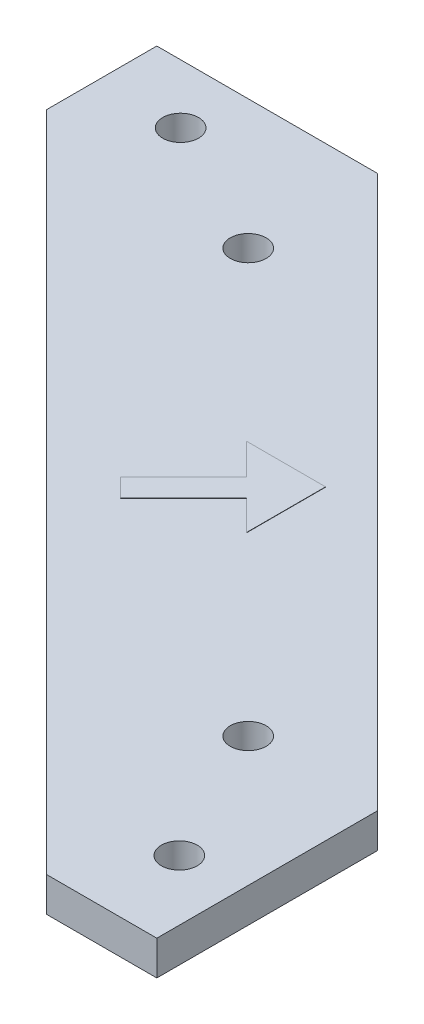
ISO-10303-21;
HEADER;
FILE_DESCRIPTION(('STEP AP214'),'2;1');
FILE_NAME('part.step','',(''),(''),'','','');
FILE_SCHEMA(('AUTOMOTIVE_DESIGN { 1 0 10303 214 1 1 1 1 }'));
ENDSEC;
DATA;
#1=APPLICATION_CONTEXT('core data for automotive mechanical design processes');
#2=APPLICATION_PROTOCOL_DEFINITION('international standard','automotive_design',2000,#1);
#3=PRODUCT_CONTEXT('',#1,'mechanical');
#4=PRODUCT('Part','Part','',(#3));
#5=PRODUCT_RELATED_PRODUCT_CATEGORY('part','',(#4));
#6=PRODUCT_DEFINITION_FORMATION('','',#4);
#7=PRODUCT_DEFINITION_CONTEXT('part definition',#1,'design');
#8=PRODUCT_DEFINITION('design','',#6,#7);
#9=PRODUCT_DEFINITION_SHAPE('','',#8);
#10=(LENGTH_UNIT() NAMED_UNIT(*) SI_UNIT(.MILLI.,.METRE.));
#11=(NAMED_UNIT(*) PLANE_ANGLE_UNIT() SI_UNIT($,.RADIAN.));
#12=(NAMED_UNIT(*) SI_UNIT($,.STERADIAN.) SOLID_ANGLE_UNIT());
#13=UNCERTAINTY_MEASURE_WITH_UNIT(LENGTH_MEASURE(1.E-05),#10,'distance_accuracy_value','');
#14=(GEOMETRIC_REPRESENTATION_CONTEXT(3) GLOBAL_UNCERTAINTY_ASSIGNED_CONTEXT((#13)) GLOBAL_UNIT_ASSIGNED_CONTEXT((#10,
#11,#12)) REPRESENTATION_CONTEXT('',''));
#15=CARTESIAN_POINT('',(0.,0.,0.));
#16=DIRECTION('',(0.,0.,1.));
#17=DIRECTION('',(1.,0.,0.));
#18=AXIS2_PLACEMENT_3D('',#15,#16,#17);
#19=CARTESIAN_POINT('',(0.,3.175,0.));
#20=DIRECTION('',(0.,1.,0.));
#21=DIRECTION('',(0.,0.,1.));
#22=AXIS2_PLACEMENT_3D('',#19,#20,#21);
#23=PLANE('',#22);
#24=CARTESIAN_POINT('',(-63.5,3.175,5.42925000000001));
#25=DIRECTION('',(0.,1.,0.));
#26=DIRECTION('',(0.,0.,1.));
#27=AXIS2_PLACEMENT_3D('',#24,#25,#26);
#28=CIRCLE('',#27,1.65099999999998);
#29=CARTESIAN_POINT('',(-63.5,3.175,7.08024999999999));
#30=VERTEX_POINT('',#29);
#31=EDGE_CURVE('E170',#30,#30,#28,.T.);
#32=ORIENTED_EDGE('',*,*,#31,.F.);
#33=EDGE_LOOP('',(#32));
#34=FACE_BOUND('',#33,.T.);
#35=CARTESIAN_POINT('',(-50.8,3.175,11.90625));
#36=DIRECTION('',(0.,1.,0.));
#37=DIRECTION('',(0.,0.,1.));
#38=AXIS2_PLACEMENT_3D('',#35,#36,#37);
#39=CIRCLE('',#38,1.65099999999999);
#40=CARTESIAN_POINT('',(-50.8,3.175,13.55725));
#41=VERTEX_POINT('',#40);
#42=EDGE_CURVE('E222',#41,#41,#39,.T.);
#43=ORIENTED_EDGE('',*,*,#42,.F.);
#44=EDGE_LOOP('',(#43));
#45=FACE_BOUND('',#44,.T.);
#46=CARTESIAN_POINT('',(-5.55624999999999,3.175,63.4921081380802));
#47=DIRECTION('',(0.,1.,0.));
#48=DIRECTION('',(0.,0.,1.));
#49=AXIS2_PLACEMENT_3D('',#46,#47,#48);
#50=CIRCLE('',#49,1.65099999999999);
#51=CARTESIAN_POINT('',(-5.55624999999999,3.175,65.1431081380802));
#52=VERTEX_POINT('',#51);
#53=EDGE_CURVE('E414',#52,#52,#50,.T.);
#54=ORIENTED_EDGE('',*,*,#53,.F.);
#55=EDGE_LOOP('',(#54));
#56=FACE_BOUND('',#55,.T.);
#57=CARTESIAN_POINT('',(-11.90625,3.175,50.8));
#58=DIRECTION('',(0.,1.,0.));
#59=DIRECTION('',(0.,0.,1.));
#60=AXIS2_PLACEMENT_3D('',#57,#58,#59);
#61=CIRCLE('',#60,1.651);
#62=CARTESIAN_POINT('',(-11.90625,3.175,52.451));
#63=VERTEX_POINT('',#62);
#64=EDGE_CURVE('E418',#63,#63,#61,.T.);
#65=ORIENTED_EDGE('',*,*,#64,.F.);
#66=EDGE_LOOP('',(#65));
#67=FACE_BOUND('',#66,.T.);
#68=DIRECTION('',(-1.,0.,0.));
#69=VECTOR('',#68,1.);
#70=CARTESIAN_POINT('',(0.,3.175,71.12));
#71=LINE('',#70,#69);
#72=CARTESIAN_POINT('',(0.,3.175,71.12));
#73=VERTEX_POINT('',#72);
#74=CARTESIAN_POINT('',(-10.16,3.175,71.12));
#75=VERTEX_POINT('',#74);
#76=EDGE_CURVE('E422',#73,#75,#71,.T.);
#77=ORIENTED_EDGE('',*,*,#76,.F.);
#78=DIRECTION('',(0.,0.,1.));
#79=VECTOR('',#78,1.);
#80=CARTESIAN_POINT('',(0.,3.175,0.));
#81=LINE('',#80,#79);
#82=CARTESIAN_POINT('',(0.,3.175,50.8));
#83=VERTEX_POINT('',#82);
#84=EDGE_CURVE('E425',#83,#73,#81,.T.);
#85=ORIENTED_EDGE('',*,*,#84,.F.);
#86=DIRECTION('',(0.707106781186548,0.,0.707106781186548));
#87=VECTOR('',#86,1.);
#88=CARTESIAN_POINT('',(-25.4,3.175,25.4));
#89=LINE('',#88,#87);
#90=CARTESIAN_POINT('',(-50.8,3.175,0.));
#91=VERTEX_POINT('',#90);
#92=EDGE_CURVE('E126',#91,#83,#89,.T.);
#93=ORIENTED_EDGE('',*,*,#92,.F.);
#94=DIRECTION('',(-1.,0.,0.));
#95=VECTOR('',#94,1.);
#96=CARTESIAN_POINT('',(0.,3.175,0.));
#97=LINE('',#96,#95);
#98=CARTESIAN_POINT('',(-71.12,3.175,0.));
#99=VERTEX_POINT('',#98);
#100=EDGE_CURVE('E119',#91,#99,#97,.T.);
#101=ORIENTED_EDGE('',*,*,#100,.T.);
#102=DIRECTION('',(0.,0.,1.));
#103=VECTOR('',#102,1.);
#104=CARTESIAN_POINT('',(-71.12,3.175,0.));
#105=LINE('',#104,#103);
#106=CARTESIAN_POINT('',(-71.12,3.175,10.16));
#107=VERTEX_POINT('',#106);
#108=EDGE_CURVE('E109',#99,#107,#105,.T.);
#109=ORIENTED_EDGE('',*,*,#108,.T.);
#110=DIRECTION('',(0.707106781186548,0.,0.707106781186547));
#111=VECTOR('',#110,1.);
#112=CARTESIAN_POINT('',(-40.64,3.175,40.64));
#113=LINE('',#112,#111);
#114=EDGE_CURVE('E66',#107,#75,#113,.T.);
#115=ORIENTED_EDGE('',*,*,#114,.T.);
#116=EDGE_LOOP('',(#77,#85,#93,#101,#109,#115));
#117=FACE_BOUND('',#116,.T.);
#118=DIRECTION('',(-1.,0.,0.));
#119=VECTOR('',#118,1.);
#120=CARTESIAN_POINT('',(-28.1859829338365,3.175,27.4008880328545));
#121=LINE('',#120,#119);
#122=CARTESIAN_POINT('',(-28.1859829338365,3.175,27.4008880328545));
#123=VERTEX_POINT('',#122);
#124=CARTESIAN_POINT('',(-35.4748823051124,3.175,27.4008880328545));
#125=VERTEX_POINT('',#124);
#126=EDGE_CURVE('E470',#123,#125,#121,.T.);
#127=ORIENTED_EDGE('',*,*,#126,.F.);
#128=DIRECTION('',(0.,0.,-1.));
#129=VECTOR('',#128,1.);
#130=CARTESIAN_POINT('',(-28.1859829338365,3.175,27.4008880328545));
#131=LINE('',#130,#129);
#132=CARTESIAN_POINT('',(-28.1859829338365,3.175,34.6897874041304));
#133=VERTEX_POINT('',#132);
#134=EDGE_CURVE('E397',#133,#123,#131,.T.);
#135=ORIENTED_EDGE('',*,*,#134,.F.);
#136=DIRECTION('',(0.707106781186548,0.,0.707106781186548));
#137=VECTOR('',#136,1.);
#138=CARTESIAN_POINT('',(-28.1859829338365,3.175,34.6897874041304));
#139=LINE('',#138,#137);
#140=CARTESIAN_POINT('',(-30.9407107968624,3.175,31.9350595411045));
#141=VERTEX_POINT('',#140);
#142=EDGE_CURVE('E391',#141,#133,#139,.T.);
#143=ORIENTED_EDGE('',*,*,#142,.F.);
#144=DIRECTION('',(0.707106781186548,0.,-0.707106781186548));
#145=VECTOR('',#144,1.);
#146=CARTESIAN_POINT('',(-30.9407107968624,3.175,31.9350595411045));
#147=LINE('',#146,#145);
#148=CARTESIAN_POINT('',(-36.7299801539523,3.175,37.7243288981944));
#149=VERTEX_POINT('',#148);
#150=EDGE_CURVE('E455',#149,#141,#147,.T.);
#151=ORIENTED_EDGE('',*,*,#150,.F.);
#152=DIRECTION('',(0.707106781186546,0.,0.707106781186549));
#153=VECTOR('',#152,1.);
#154=CARTESIAN_POINT('',(-38.3847186848957,3.175,36.069590367251));
#155=LINE('',#154,#153);
#156=CARTESIAN_POINT('',(-38.3847186848957,3.175,36.069590367251));
#157=VERTEX_POINT('',#156);
#158=EDGE_CURVE('E458',#157,#149,#155,.T.);
#159=ORIENTED_EDGE('',*,*,#158,.F.);
#160=DIRECTION('',(-0.707106781186548,0.,0.707106781186548));
#161=VECTOR('',#160,1.);
#162=CARTESIAN_POINT('',(-32.5954493278058,3.175,30.2803210101611));
#163=LINE('',#162,#161);
#164=CARTESIAN_POINT('',(-32.5954493278058,3.175,30.2803210101611));
#165=VERTEX_POINT('',#164);
#166=EDGE_CURVE('E462',#165,#157,#163,.T.);
#167=ORIENTED_EDGE('',*,*,#166,.F.);
#168=DIRECTION('',(0.707106781186547,0.,0.707106781186548));
#169=VECTOR('',#168,1.);
#170=CARTESIAN_POINT('',(-35.4748823051124,3.175,27.4008880328545));
#171=LINE('',#170,#169);
#172=EDGE_CURVE('E466',#125,#165,#171,.T.);
#173=ORIENTED_EDGE('',*,*,#172,.F.);
#174=EDGE_LOOP('',(#127,#135,#143,#151,#159,#167,#173));
#175=FACE_BOUND('',#174,.T.);
#176=ADVANCED_FACE('F41',(#34,#45,#56,#67,#117,#175),#23,.T.);
#177=CARTESIAN_POINT('',(0.,3.175,71.12));
#178=DIRECTION('',(0.,0.,1.));
#179=DIRECTION('',(1.,0.,0.));
#180=AXIS2_PLACEMENT_3D('',#177,#178,#179);
#181=PLANE('',#180);
#182=DIRECTION('',(-1.,0.,0.));
#183=VECTOR('',#182,1.);
#184=CARTESIAN_POINT('',(0.,0.,71.12));
#185=LINE('',#184,#183);
#186=CARTESIAN_POINT('',(0.,0.,71.12));
#187=VERTEX_POINT('',#186);
#188=CARTESIAN_POINT('',(-10.16,0.,71.12));
#189=VERTEX_POINT('',#188);
#190=EDGE_CURVE('E156',#187,#189,#185,.T.);
#191=ORIENTED_EDGE('',*,*,#190,.F.);
#192=DIRECTION('',(0.,-1.,0.));
#193=VECTOR('',#192,1.);
#194=CARTESIAN_POINT('',(0.,3.175,71.12));
#195=LINE('',#194,#193);
#196=EDGE_CURVE('E11',#73,#187,#195,.T.);
#197=ORIENTED_EDGE('',*,*,#196,.F.);
#198=ORIENTED_EDGE('',*,*,#76,.T.);
#199=DIRECTION('',(0.,-1.,0.));
#200=VECTOR('',#199,1.);
#201=CARTESIAN_POINT('',(-10.16,3.175,71.12));
#202=LINE('',#201,#200);
#203=EDGE_CURVE('E92',#75,#189,#202,.T.);
#204=ORIENTED_EDGE('',*,*,#203,.T.);
#205=EDGE_LOOP('',(#191,#197,#198,#204));
#206=FACE_BOUND('',#205,.T.);
#207=ADVANCED_FACE('F192',(#206),#181,.T.);
#208=CARTESIAN_POINT('',(0.,3.175,0.));
#209=DIRECTION('',(1.,0.,0.));
#210=DIRECTION('',(0.,0.,-1.));
#211=AXIS2_PLACEMENT_3D('',#208,#209,#210);
#212=PLANE('',#211);
#213=DIRECTION('',(0.,0.,1.));
#214=VECTOR('',#213,1.);
#215=CARTESIAN_POINT('',(0.,0.,0.));
#216=LINE('',#215,#214);
#217=CARTESIAN_POINT('',(0.,0.,50.8));
#218=VERTEX_POINT('',#217);
#219=EDGE_CURVE('E151',#218,#187,#216,.T.);
#220=ORIENTED_EDGE('',*,*,#219,.F.);
#221=DIRECTION('',(0.,-1.,0.));
#222=VECTOR('',#221,1.);
#223=CARTESIAN_POINT('',(0.,3.175,50.8));
#224=LINE('',#223,#222);
#225=EDGE_CURVE('E50',#83,#218,#224,.T.);
#226=ORIENTED_EDGE('',*,*,#225,.F.);
#227=ORIENTED_EDGE('',*,*,#84,.T.);
#228=ORIENTED_EDGE('',*,*,#196,.T.);
#229=EDGE_LOOP('',(#220,#226,#227,#228));
#230=FACE_BOUND('',#229,.T.);
#231=ADVANCED_FACE('F152',(#230),#212,.T.);
#232=CARTESIAN_POINT('',(-25.4,3.175,25.4));
#233=DIRECTION('',(0.707106781186548,0.,-0.707106781186548));
#234=DIRECTION('',(-0.707106781186548,0.,-0.707106781186548));
#235=AXIS2_PLACEMENT_3D('',#232,#233,#234);
#236=PLANE('',#235);
#237=DIRECTION('',(0.707106781186548,0.,0.707106781186548));
#238=VECTOR('',#237,1.);
#239=CARTESIAN_POINT('',(-25.4,0.,25.4));
#240=LINE('',#239,#238);
#241=CARTESIAN_POINT('',(-50.8,0.,0.));
#242=VERTEX_POINT('',#241);
#243=EDGE_CURVE('E147',#242,#218,#240,.T.);
#244=ORIENTED_EDGE('',*,*,#243,.F.);
#245=DIRECTION('',(0.,-1.,0.));
#246=VECTOR('',#245,1.);
#247=CARTESIAN_POINT('',(-50.8,3.175,0.));
#248=LINE('',#247,#246);
#249=EDGE_CURVE('E134',#91,#242,#248,.T.);
#250=ORIENTED_EDGE('',*,*,#249,.F.);
#251=ORIENTED_EDGE('',*,*,#92,.T.);
#252=ORIENTED_EDGE('',*,*,#225,.T.);
#253=EDGE_LOOP('',(#244,#250,#251,#252));
#254=FACE_BOUND('',#253,.T.);
#255=ADVANCED_FACE('F145',(#254),#236,.T.);
#256=CARTESIAN_POINT('',(0.,3.175,0.));
#257=DIRECTION('',(0.,0.,1.));
#258=DIRECTION('',(1.,0.,0.));
#259=AXIS2_PLACEMENT_3D('',#256,#257,#258);
#260=PLANE('',#259);
#261=DIRECTION('',(-1.,0.,0.));
#262=VECTOR('',#261,1.);
#263=CARTESIAN_POINT('',(0.,0.,0.));
#264=LINE('',#263,#262);
#265=CARTESIAN_POINT('',(-71.12,0.,0.));
#266=VERTEX_POINT('',#265);
#267=EDGE_CURVE('E132',#242,#266,#264,.T.);
#268=ORIENTED_EDGE('',*,*,#267,.T.);
#269=DIRECTION('',(0.,-1.,0.));
#270=VECTOR('',#269,1.);
#271=CARTESIAN_POINT('',(-71.12,3.175,0.));
#272=LINE('',#271,#270);
#273=EDGE_CURVE('E114',#99,#266,#272,.T.);
#274=ORIENTED_EDGE('',*,*,#273,.F.);
#275=ORIENTED_EDGE('',*,*,#100,.F.);
#276=ORIENTED_EDGE('',*,*,#249,.T.);
#277=EDGE_LOOP('',(#268,#274,#275,#276));
#278=FACE_BOUND('',#277,.T.);
#279=ADVANCED_FACE('F130',(#278),#260,.F.);
#280=CARTESIAN_POINT('',(-71.12,3.175,0.));
#281=DIRECTION('',(1.,0.,0.));
#282=DIRECTION('',(0.,0.,-1.));
#283=AXIS2_PLACEMENT_3D('',#280,#281,#282);
#284=PLANE('',#283);
#285=DIRECTION('',(0.,0.,1.));
#286=VECTOR('',#285,1.);
#287=CARTESIAN_POINT('',(-71.12,0.,0.));
#288=LINE('',#287,#286);
#289=CARTESIAN_POINT('',(-71.12,0.,10.16));
#290=VERTEX_POINT('',#289);
#291=EDGE_CURVE('E162',#266,#290,#288,.T.);
#292=ORIENTED_EDGE('',*,*,#291,.T.);
#293=DIRECTION('',(0.,-1.,0.));
#294=VECTOR('',#293,1.);
#295=CARTESIAN_POINT('',(-71.12,3.175,10.16));
#296=LINE('',#295,#294);
#297=EDGE_CURVE('E117',#107,#290,#296,.T.);
#298=ORIENTED_EDGE('',*,*,#297,.F.);
#299=ORIENTED_EDGE('',*,*,#108,.F.);
#300=ORIENTED_EDGE('',*,*,#273,.T.);
#301=EDGE_LOOP('',(#292,#298,#299,#300));
#302=FACE_BOUND('',#301,.T.);
#303=ADVANCED_FACE('F112',(#302),#284,.F.);
#304=CARTESIAN_POINT('',(-11.90625,3.175,50.8));
#305=DIRECTION('',(0.,-1.,0.));
#306=DIRECTION('',(0.,0.,-1.));
#307=AXIS2_PLACEMENT_3D('',#304,#305,#306);
#308=CYLINDRICAL_SURFACE('',#307,1.651);
#309=ORIENTED_EDGE('',*,*,#64,.T.);
#310=EDGE_LOOP('',(#309));
#311=FACE_BOUND('',#310,.T.);
#312=CARTESIAN_POINT('',(-11.90625,0.,50.8));
#313=DIRECTION('',(0.,1.,0.));
#314=DIRECTION('',(0.,0.,1.));
#315=AXIS2_PLACEMENT_3D('',#312,#313,#314);
#316=CIRCLE('',#315,1.651);
#317=CARTESIAN_POINT('',(-11.90625,0.,52.451));
#318=VERTEX_POINT('',#317);
#319=EDGE_CURVE('E188',#318,#318,#316,.T.);
#320=ORIENTED_EDGE('',*,*,#319,.F.);
#321=EDGE_LOOP('',(#320));
#322=FACE_BOUND('',#321,.T.);
#323=ADVANCED_FACE('F204',(#311,#322),#308,.F.);
#324=CARTESIAN_POINT('',(-5.55624999999999,3.175,63.4921081380802));
#325=DIRECTION('',(0.,-1.,0.));
#326=DIRECTION('',(0.,0.,-1.));
#327=AXIS2_PLACEMENT_3D('',#324,#325,#326);
#328=CYLINDRICAL_SURFACE('',#327,1.65099999999999);
#329=ORIENTED_EDGE('',*,*,#53,.T.);
#330=EDGE_LOOP('',(#329));
#331=FACE_BOUND('',#330,.T.);
#332=CARTESIAN_POINT('',(-5.55624999999999,0.,63.4921081380802));
#333=DIRECTION('',(0.,1.,0.));
#334=DIRECTION('',(0.,0.,1.));
#335=AXIS2_PLACEMENT_3D('',#332,#333,#334);
#336=CIRCLE('',#335,1.65099999999999);
#337=CARTESIAN_POINT('',(-5.55624999999999,0.,65.1431081380802));
#338=VERTEX_POINT('',#337);
#339=EDGE_CURVE('E184',#338,#338,#336,.T.);
#340=ORIENTED_EDGE('',*,*,#339,.F.);
#341=EDGE_LOOP('',(#340));
#342=FACE_BOUND('',#341,.T.);
#343=ADVANCED_FACE('F207',(#331,#342),#328,.F.);
#344=CARTESIAN_POINT('',(-50.8,3.175,11.90625));
#345=DIRECTION('',(0.,-1.,0.));
#346=DIRECTION('',(0.,0.,-1.));
#347=AXIS2_PLACEMENT_3D('',#344,#345,#346);
#348=CYLINDRICAL_SURFACE('',#347,1.65099999999999);
#349=ORIENTED_EDGE('',*,*,#42,.T.);
#350=EDGE_LOOP('',(#349));
#351=FACE_BOUND('',#350,.T.);
#352=CARTESIAN_POINT('',(-50.8,0.,11.90625));
#353=DIRECTION('',(0.,1.,0.));
#354=DIRECTION('',(0.,0.,1.));
#355=AXIS2_PLACEMENT_3D('',#352,#353,#354);
#356=CIRCLE('',#355,1.65099999999999);
#357=CARTESIAN_POINT('',(-50.8,0.,13.55725));
#358=VERTEX_POINT('',#357);
#359=EDGE_CURVE('E179',#358,#358,#356,.T.);
#360=ORIENTED_EDGE('',*,*,#359,.F.);
#361=EDGE_LOOP('',(#360));
#362=FACE_BOUND('',#361,.T.);
#363=ADVANCED_FACE('F210',(#351,#362),#348,.F.);
#364=CARTESIAN_POINT('',(-63.5,3.175,5.42925000000001));
#365=DIRECTION('',(0.,-1.,0.));
#366=DIRECTION('',(0.,0.,-1.));
#367=AXIS2_PLACEMENT_3D('',#364,#365,#366);
#368=CYLINDRICAL_SURFACE('',#367,1.65099999999998);
#369=ORIENTED_EDGE('',*,*,#31,.T.);
#370=EDGE_LOOP('',(#369));
#371=FACE_BOUND('',#370,.T.);
#372=CARTESIAN_POINT('',(-63.5,0.,5.42925000000001));
#373=DIRECTION('',(0.,1.,0.));
#374=DIRECTION('',(0.,0.,1.));
#375=AXIS2_PLACEMENT_3D('',#372,#373,#374);
#376=CIRCLE('',#375,1.65099999999998);
#377=CARTESIAN_POINT('',(-63.5,0.,7.08024999999999));
#378=VERTEX_POINT('',#377);
#379=EDGE_CURVE('E175',#378,#378,#376,.T.);
#380=ORIENTED_EDGE('',*,*,#379,.F.);
#381=EDGE_LOOP('',(#380));
#382=FACE_BOUND('',#381,.T.);
#383=ADVANCED_FACE('F43',(#371,#382),#368,.F.);
#384=CARTESIAN_POINT('',(-40.64,3.175,40.64));
#385=DIRECTION('',(0.707106781186547,0.,-0.707106781186548));
#386=DIRECTION('',(-0.707106781186548,0.,-0.707106781186547));
#387=AXIS2_PLACEMENT_3D('',#384,#385,#386);
#388=PLANE('',#387);
#389=DIRECTION('',(0.707106781186548,0.,0.707106781186547));
#390=VECTOR('',#389,1.);
#391=CARTESIAN_POINT('',(-40.64,0.,40.64));
#392=LINE('',#391,#390);
#393=EDGE_CURVE('E168',#290,#189,#392,.T.);
#394=ORIENTED_EDGE('',*,*,#393,.T.);
#395=ORIENTED_EDGE('',*,*,#203,.F.);
#396=ORIENTED_EDGE('',*,*,#114,.F.);
#397=ORIENTED_EDGE('',*,*,#297,.T.);
#398=EDGE_LOOP('',(#394,#395,#396,#397));
#399=FACE_BOUND('',#398,.T.);
#400=ADVANCED_FACE('F217',(#399),#388,.F.);
#401=CARTESIAN_POINT('',(0.,0.,0.));
#402=DIRECTION('',(0.,1.,0.));
#403=DIRECTION('',(0.,0.,1.));
#404=AXIS2_PLACEMENT_3D('',#401,#402,#403);
#405=PLANE('',#404);
#406=ORIENTED_EDGE('',*,*,#379,.T.);
#407=EDGE_LOOP('',(#406));
#408=FACE_BOUND('',#407,.T.);
#409=ORIENTED_EDGE('',*,*,#359,.T.);
#410=EDGE_LOOP('',(#409));
#411=FACE_BOUND('',#410,.T.);
#412=ORIENTED_EDGE('',*,*,#339,.T.);
#413=EDGE_LOOP('',(#412));
#414=FACE_BOUND('',#413,.T.);
#415=ORIENTED_EDGE('',*,*,#319,.T.);
#416=EDGE_LOOP('',(#415));
#417=FACE_BOUND('',#416,.T.);
#418=ORIENTED_EDGE('',*,*,#190,.T.);
#419=ORIENTED_EDGE('',*,*,#393,.F.);
#420=ORIENTED_EDGE('',*,*,#291,.F.);
#421=ORIENTED_EDGE('',*,*,#267,.F.);
#422=ORIENTED_EDGE('',*,*,#243,.T.);
#423=ORIENTED_EDGE('',*,*,#219,.T.);
#424=EDGE_LOOP('',(#418,#419,#420,#421,#422,#423));
#425=FACE_BOUND('',#424,.T.);
#426=ADVANCED_FACE('F158',(#408,#411,#414,#417,#425),#405,.F.);
#427=CARTESIAN_POINT('',(-28.1859829338365,3.2004,27.4008880328545));
#428=DIRECTION('',(-1.,0.,0.));
#429=DIRECTION('',(0.,0.,1.));
#430=AXIS2_PLACEMENT_3D('',#427,#428,#429);
#431=PLANE('',#430);
#432=ORIENTED_EDGE('',*,*,#134,.T.);
#433=DIRECTION('',(0.,-1.,0.));
#434=VECTOR('',#433,1.);
#435=CARTESIAN_POINT('',(-28.1859829338365,3.2004,27.4008880328545));
#436=LINE('',#435,#434);
#437=CARTESIAN_POINT('',(-28.1859829338365,3.2004,27.4008880328545));
#438=VERTEX_POINT('',#437);
#439=EDGE_CURVE('E180',#438,#123,#436,.T.);
#440=ORIENTED_EDGE('',*,*,#439,.F.);
#441=DIRECTION('',(0.,0.,-1.));
#442=VECTOR('',#441,1.);
#443=CARTESIAN_POINT('',(-28.1859829338365,3.2004,27.4008880328545));
#444=LINE('',#443,#442);
#445=CARTESIAN_POINT('',(-28.1859829338365,3.2004,34.6897874041304));
#446=VERTEX_POINT('',#445);
#447=EDGE_CURVE('E378',#446,#438,#444,.T.);
#448=ORIENTED_EDGE('',*,*,#447,.F.);
#449=DIRECTION('',(0.,-1.,0.));
#450=VECTOR('',#449,1.);
#451=CARTESIAN_POINT('',(-28.1859829338365,3.2004,34.6897874041304));
#452=LINE('',#451,#450);
#453=EDGE_CURVE('E450',#446,#133,#452,.T.);
#454=ORIENTED_EDGE('',*,*,#453,.T.);
#455=EDGE_LOOP('',(#432,#440,#448,#454));
#456=FACE_BOUND('',#455,.T.);
#457=ADVANCED_FACE('F227',(#456),#431,.F.);
#458=CARTESIAN_POINT('',(-28.1859829338365,3.2004,27.4008880328545));
#459=DIRECTION('',(0.,0.,1.));
#460=DIRECTION('',(1.,0.,0.));
#461=AXIS2_PLACEMENT_3D('',#458,#459,#460);
#462=PLANE('',#461);
#463=ORIENTED_EDGE('',*,*,#126,.T.);
#464=DIRECTION('',(0.,-1.,0.));
#465=VECTOR('',#464,1.);
#466=CARTESIAN_POINT('',(-35.4748823051124,3.2004,27.4008880328545));
#467=LINE('',#466,#465);
#468=CARTESIAN_POINT('',(-35.4748823051124,3.2004,27.4008880328545));
#469=VERTEX_POINT('',#468);
#470=EDGE_CURVE('E401',#469,#125,#467,.T.);
#471=ORIENTED_EDGE('',*,*,#470,.F.);
#472=DIRECTION('',(-1.,0.,0.));
#473=VECTOR('',#472,1.);
#474=CARTESIAN_POINT('',(-28.1859829338365,3.2004,27.4008880328545));
#475=LINE('',#474,#473);
#476=EDGE_CURVE('E383',#438,#469,#475,.T.);
#477=ORIENTED_EDGE('',*,*,#476,.F.);
#478=ORIENTED_EDGE('',*,*,#439,.T.);
#479=EDGE_LOOP('',(#463,#471,#477,#478));
#480=FACE_BOUND('',#479,.T.);
#481=ADVANCED_FACE('F239',(#480),#462,.F.);
#482=CARTESIAN_POINT('',(-35.4748823051124,3.2004,27.4008880328545));
#483=DIRECTION('',(0.707106781186548,0.,-0.707106781186547));
#484=DIRECTION('',(-0.707106781186547,0.,-0.707106781186548));
#485=AXIS2_PLACEMENT_3D('',#482,#483,#484);
#486=PLANE('',#485);
#487=ORIENTED_EDGE('',*,*,#172,.T.);
#488=DIRECTION('',(0.,-1.,0.));
#489=VECTOR('',#488,1.);
#490=CARTESIAN_POINT('',(-32.5954493278058,3.2004,30.2803210101611));
#491=LINE('',#490,#489);
#492=CARTESIAN_POINT('',(-32.5954493278058,3.2004,30.2803210101611));
#493=VERTEX_POINT('',#492);
#494=EDGE_CURVE('E405',#493,#165,#491,.T.);
#495=ORIENTED_EDGE('',*,*,#494,.F.);
#496=DIRECTION('',(0.707106781186547,0.,0.707106781186548));
#497=VECTOR('',#496,1.);
#498=CARTESIAN_POINT('',(-35.4748823051124,3.2004,27.4008880328545));
#499=LINE('',#498,#497);
#500=EDGE_CURVE('E488',#469,#493,#499,.T.);
#501=ORIENTED_EDGE('',*,*,#500,.F.);
#502=ORIENTED_EDGE('',*,*,#470,.T.);
#503=EDGE_LOOP('',(#487,#495,#501,#502));
#504=FACE_BOUND('',#503,.T.);
#505=ADVANCED_FACE('F310',(#504),#486,.F.);
#506=CARTESIAN_POINT('',(-32.5954493278058,3.2004,30.2803210101611));
#507=DIRECTION('',(0.707106781186548,0.,0.707106781186548));
#508=DIRECTION('',(0.707106781186548,0.,-0.707106781186548));
#509=AXIS2_PLACEMENT_3D('',#506,#507,#508);
#510=PLANE('',#509);
#511=ORIENTED_EDGE('',*,*,#166,.T.);
#512=DIRECTION('',(0.,-1.,0.));
#513=VECTOR('',#512,1.);
#514=CARTESIAN_POINT('',(-38.3847186848957,3.2004,36.069590367251));
#515=LINE('',#514,#513);
#516=CARTESIAN_POINT('',(-38.3847186848957,3.2004,36.069590367251));
#517=VERTEX_POINT('',#516);
#518=EDGE_CURVE('E440',#517,#157,#515,.T.);
#519=ORIENTED_EDGE('',*,*,#518,.F.);
#520=DIRECTION('',(-0.707106781186548,0.,0.707106781186548));
#521=VECTOR('',#520,1.);
#522=CARTESIAN_POINT('',(-32.5954493278058,3.2004,30.2803210101611));
#523=LINE('',#522,#521);
#524=EDGE_CURVE('E484',#493,#517,#523,.T.);
#525=ORIENTED_EDGE('',*,*,#524,.F.);
#526=ORIENTED_EDGE('',*,*,#494,.T.);
#527=EDGE_LOOP('',(#511,#519,#525,#526));
#528=FACE_BOUND('',#527,.T.);
#529=ADVANCED_FACE('F320',(#528),#510,.F.);
#530=CARTESIAN_POINT('',(-38.3847186848957,3.2004,36.069590367251));
#531=DIRECTION('',(0.707106781186549,0.,-0.707106781186546));
#532=DIRECTION('',(-0.707106781186546,0.,-0.707106781186549));
#533=AXIS2_PLACEMENT_3D('',#530,#531,#532);
#534=PLANE('',#533);
#535=ORIENTED_EDGE('',*,*,#158,.T.);
#536=DIRECTION('',(0.,-1.,0.));
#537=VECTOR('',#536,1.);
#538=CARTESIAN_POINT('',(-36.7299801539523,3.2004,37.7243288981944));
#539=LINE('',#538,#537);
#540=CARTESIAN_POINT('',(-36.7299801539523,3.2004,37.7243288981944));
#541=VERTEX_POINT('',#540);
#542=EDGE_CURVE('E444',#541,#149,#539,.T.);
#543=ORIENTED_EDGE('',*,*,#542,.F.);
#544=DIRECTION('',(0.707106781186546,0.,0.707106781186549));
#545=VECTOR('',#544,1.);
#546=CARTESIAN_POINT('',(-38.3847186848957,3.2004,36.069590367251));
#547=LINE('',#546,#545);
#548=EDGE_CURVE('E480',#517,#541,#547,.T.);
#549=ORIENTED_EDGE('',*,*,#548,.F.);
#550=ORIENTED_EDGE('',*,*,#518,.T.);
#551=EDGE_LOOP('',(#535,#543,#549,#550));
#552=FACE_BOUND('',#551,.T.);
#553=ADVANCED_FACE('F330',(#552),#534,.F.);
#554=CARTESIAN_POINT('',(-30.9407107968624,3.2004,31.9350595411045));
#555=DIRECTION('',(-0.707106781186548,0.,-0.707106781186548));
#556=DIRECTION('',(-0.707106781186548,0.,0.707106781186548));
#557=AXIS2_PLACEMENT_3D('',#554,#555,#556);
#558=PLANE('',#557);
#559=ORIENTED_EDGE('',*,*,#150,.T.);
#560=DIRECTION('',(0.,-1.,0.));
#561=VECTOR('',#560,1.);
#562=CARTESIAN_POINT('',(-30.9407107968624,3.2004,31.9350595411045));
#563=LINE('',#562,#561);
#564=CARTESIAN_POINT('',(-30.9407107968624,3.2004,31.9350595411045));
#565=VERTEX_POINT('',#564);
#566=EDGE_CURVE('E57',#565,#141,#563,.T.);
#567=ORIENTED_EDGE('',*,*,#566,.F.);
#568=DIRECTION('',(0.707106781186548,0.,-0.707106781186548));
#569=VECTOR('',#568,1.);
#570=CARTESIAN_POINT('',(-30.9407107968624,3.2004,31.9350595411045));
#571=LINE('',#570,#569);
#572=EDGE_CURVE('E477',#541,#565,#571,.T.);
#573=ORIENTED_EDGE('',*,*,#572,.F.);
#574=ORIENTED_EDGE('',*,*,#542,.T.);
#575=EDGE_LOOP('',(#559,#567,#573,#574));
#576=FACE_BOUND('',#575,.T.);
#577=ADVANCED_FACE('F340',(#576),#558,.F.);
#578=CARTESIAN_POINT('',(-28.1859829338365,3.2004,34.6897874041304));
#579=DIRECTION('',(0.707106781186548,0.,-0.707106781186548));
#580=DIRECTION('',(-0.707106781186548,0.,-0.707106781186548));
#581=AXIS2_PLACEMENT_3D('',#578,#579,#580);
#582=PLANE('',#581);
#583=ORIENTED_EDGE('',*,*,#142,.T.);
#584=ORIENTED_EDGE('',*,*,#453,.F.);
#585=DIRECTION('',(0.707106781186548,0.,0.707106781186548));
#586=VECTOR('',#585,1.);
#587=CARTESIAN_POINT('',(-28.1859829338365,3.2004,34.6897874041304));
#588=LINE('',#587,#586);
#589=EDGE_CURVE('E386',#565,#446,#588,.T.);
#590=ORIENTED_EDGE('',*,*,#589,.F.);
#591=ORIENTED_EDGE('',*,*,#566,.T.);
#592=EDGE_LOOP('',(#583,#584,#590,#591));
#593=FACE_BOUND('',#592,.T.);
#594=ADVANCED_FACE('F350',(#593),#582,.F.);
#595=CARTESIAN_POINT('',(0.,3.2004,0.));
#596=DIRECTION('',(0.,-1.,0.));
#597=DIRECTION('',(0.,0.,-1.));
#598=AXIS2_PLACEMENT_3D('',#595,#596,#597);
#599=PLANE('',#598);
#600=ORIENTED_EDGE('',*,*,#447,.T.);
#601=ORIENTED_EDGE('',*,*,#476,.T.);
#602=ORIENTED_EDGE('',*,*,#500,.T.);
#603=ORIENTED_EDGE('',*,*,#524,.T.);
#604=ORIENTED_EDGE('',*,*,#548,.T.);
#605=ORIENTED_EDGE('',*,*,#572,.T.);
#606=ORIENTED_EDGE('',*,*,#589,.T.);
#607=EDGE_LOOP('',(#600,#601,#602,#603,#604,#605,#606));
#608=FACE_BOUND('',#607,.T.);
#609=ADVANCED_FACE('F360',(#608),#599,.F.);
#610=CLOSED_SHELL('',(#176,#207,#231,#255,#279,#303,#323,#343,#363,#383,#400,#426,#457,#481,
#505,#529,#553,#577,#594,#609));
#611=MANIFOLD_SOLID_BREP('B2',#610);
#612=ADVANCED_BREP_SHAPE_REPRESENTATION('',(#18,#611),#14);
#613=SHAPE_DEFINITION_REPRESENTATION(#9,#612);
ENDSEC;
END-ISO-10303-21;
